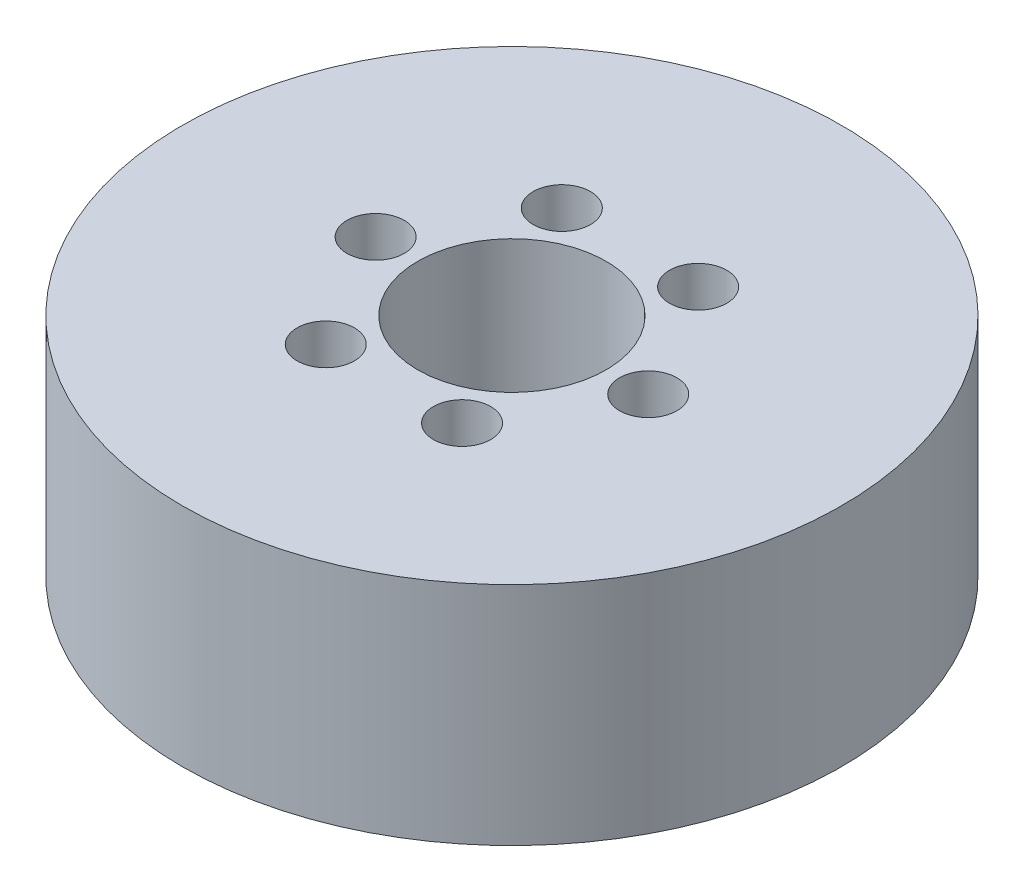
ISO-10303-21;
HEADER;
FILE_DESCRIPTION(('STEP AP214'),'2;1');
FILE_NAME('part.step','',(''),(''),'','','');
FILE_SCHEMA(('AUTOMOTIVE_DESIGN { 1 0 10303 214 1 1 1 1 }'));
ENDSEC;
DATA;
#1=APPLICATION_CONTEXT('core data for automotive mechanical design processes');
#2=APPLICATION_PROTOCOL_DEFINITION('international standard','automotive_design',2000,#1);
#3=PRODUCT_CONTEXT('',#1,'mechanical');
#4=PRODUCT('Part','Part','',(#3));
#5=PRODUCT_RELATED_PRODUCT_CATEGORY('part','',(#4));
#6=PRODUCT_DEFINITION_FORMATION('','',#4);
#7=PRODUCT_DEFINITION_CONTEXT('part definition',#1,'design');
#8=PRODUCT_DEFINITION('design','',#6,#7);
#9=PRODUCT_DEFINITION_SHAPE('','',#8);
#10=(LENGTH_UNIT() NAMED_UNIT(*) SI_UNIT(.MILLI.,.METRE.));
#11=(NAMED_UNIT(*) PLANE_ANGLE_UNIT() SI_UNIT($,.RADIAN.));
#12=(NAMED_UNIT(*) SI_UNIT($,.STERADIAN.) SOLID_ANGLE_UNIT());
#13=UNCERTAINTY_MEASURE_WITH_UNIT(LENGTH_MEASURE(1.E-05),#10,'distance_accuracy_value','');
#14=(GEOMETRIC_REPRESENTATION_CONTEXT(3) GLOBAL_UNCERTAINTY_ASSIGNED_CONTEXT((#13)) GLOBAL_UNIT_ASSIGNED_CONTEXT((#10,
#11,#12)) REPRESENTATION_CONTEXT('',''));
#15=CARTESIAN_POINT('',(0.,0.,0.));
#16=DIRECTION('',(0.,0.,1.));
#17=DIRECTION('',(1.,0.,0.));
#18=AXIS2_PLACEMENT_3D('',#15,#16,#17);
#19=CARTESIAN_POINT('',(0.,12.,0.));
#20=DIRECTION('',(0.,-1.,0.));
#21=DIRECTION('',(0.,0.,-1.));
#22=AXIS2_PLACEMENT_3D('',#19,#20,#21);
#23=CYLINDRICAL_SURFACE('',#22,17.5);
#24=CARTESIAN_POINT('',(0.,12.,0.));
#25=DIRECTION('',(0.,1.,0.));
#26=DIRECTION('',(0.,0.,1.));
#27=AXIS2_PLACEMENT_3D('',#24,#25,#26);
#28=CIRCLE('',#27,17.5);
#29=CARTESIAN_POINT('',(0.,12.,17.5));
#30=VERTEX_POINT('',#29);
#31=EDGE_CURVE('E10',#30,#30,#28,.T.);
#32=ORIENTED_EDGE('',*,*,#31,.F.);
#33=EDGE_LOOP('',(#32));
#34=FACE_BOUND('',#33,.T.);
#35=CARTESIAN_POINT('',(0.,0.,0.));
#36=DIRECTION('',(0.,1.,0.));
#37=DIRECTION('',(0.,0.,1.));
#38=AXIS2_PLACEMENT_3D('',#35,#36,#37);
#39=CIRCLE('',#38,17.5);
#40=CARTESIAN_POINT('',(0.,0.,17.5));
#41=VERTEX_POINT('',#40);
#42=EDGE_CURVE('E37',#41,#41,#39,.T.);
#43=ORIENTED_EDGE('',*,*,#42,.T.);
#44=EDGE_LOOP('',(#43));
#45=FACE_BOUND('',#44,.T.);
#46=ADVANCED_FACE('F40',(#34,#45),#23,.T.);
#47=CARTESIAN_POINT('',(0.,12.,0.));
#48=DIRECTION('',(0.,1.,0.));
#49=DIRECTION('',(0.,0.,1.));
#50=AXIS2_PLACEMENT_3D('',#47,#48,#49);
#51=PLANE('',#50);
#52=CARTESIAN_POINT('',(-3.61878021298596,12.,-6.26791119031643));
#53=DIRECTION('',(0.,1.,0.));
#54=DIRECTION('',(-0.866025403784433,0.,0.50000000000001));
#55=AXIS2_PLACEMENT_3D('',#52,#53,#54);
#56=CIRCLE('',#55,1.52167736658156);
#57=CARTESIAN_POINT('',(-4.93659146880939,12.,-5.50707250702564));
#58=VERTEX_POINT('',#57);
#59=EDGE_CURVE('E70',#58,#58,#56,.T.);
#60=ORIENTED_EDGE('',*,*,#59,.F.);
#61=EDGE_LOOP('',(#60));
#62=FACE_BOUND('',#61,.T.);
#63=CARTESIAN_POINT('',(3.61878021298583,12.,-6.26791119031651));
#64=DIRECTION('',(0.,1.,0.));
#65=DIRECTION('',(-0.866025403784443,0.,-0.499999999999992));
#66=AXIS2_PLACEMENT_3D('',#63,#64,#65);
#67=CIRCLE('',#66,1.52167736658156);
#68=CARTESIAN_POINT('',(2.30096895716238,12.,-7.02874987360728));
#69=VERTEX_POINT('',#68);
#70=EDGE_CURVE('E71',#69,#69,#67,.T.);
#71=ORIENTED_EDGE('',*,*,#70,.F.);
#72=EDGE_LOOP('',(#71));
#73=FACE_BOUND('',#72,.T.);
#74=CARTESIAN_POINT('',(7.23756042597177,12.,0.));
#75=DIRECTION('',(0.,1.,0.));
#76=DIRECTION('',(0.,0.,-1.));
#77=AXIS2_PLACEMENT_3D('',#74,#75,#76);
#78=CIRCLE('',#77,1.52167736658156);
#79=CARTESIAN_POINT('',(7.23756042597177,12.,-1.52167736658156));
#80=VERTEX_POINT('',#79);
#81=EDGE_CURVE('E78',#80,#80,#78,.T.);
#82=ORIENTED_EDGE('',*,*,#81,.F.);
#83=EDGE_LOOP('',(#82));
#84=FACE_BOUND('',#83,.T.);
#85=CARTESIAN_POINT('',(3.61878021298591,12.,6.26791119031646));
#86=DIRECTION('',(0.,1.,0.));
#87=DIRECTION('',(0.866025403784436,0.,-0.500000000000004));
#88=AXIS2_PLACEMENT_3D('',#85,#86,#87);
#89=CIRCLE('',#88,1.52167736658156);
#90=CARTESIAN_POINT('',(4.93659146880935,12.,5.50707250702567));
#91=VERTEX_POINT('',#90);
#92=EDGE_CURVE('E84',#91,#91,#89,.T.);
#93=ORIENTED_EDGE('',*,*,#92,.F.);
#94=EDGE_LOOP('',(#93));
#95=FACE_BOUND('',#94,.T.);
#96=CARTESIAN_POINT('',(-3.61878021298587,12.,6.26791119031648));
#97=DIRECTION('',(0.,1.,0.));
#98=DIRECTION('',(0.86602540378444,0.,0.499999999999998));
#99=AXIS2_PLACEMENT_3D('',#96,#97,#98);
#100=CIRCLE('',#99,1.52167736658156);
#101=CARTESIAN_POINT('',(-2.30096895716243,12.,7.02874987360726));
#102=VERTEX_POINT('',#101);
#103=EDGE_CURVE('E61',#102,#102,#100,.T.);
#104=ORIENTED_EDGE('',*,*,#103,.F.);
#105=EDGE_LOOP('',(#104));
#106=FACE_BOUND('',#105,.T.);
#107=CARTESIAN_POINT('',(-7.23756042597177,12.,0.));
#108=DIRECTION('',(0.,1.,0.));
#109=DIRECTION('',(0.,0.,1.));
#110=AXIS2_PLACEMENT_3D('',#107,#108,#109);
#111=CIRCLE('',#110,1.52167736658156);
#112=CARTESIAN_POINT('',(-7.23756042597177,12.,1.52167736658156));
#113=VERTEX_POINT('',#112);
#114=EDGE_CURVE('E54',#113,#113,#111,.T.);
#115=ORIENTED_EDGE('',*,*,#114,.F.);
#116=EDGE_LOOP('',(#115));
#117=FACE_BOUND('',#116,.T.);
#118=CARTESIAN_POINT('',(0.,12.,0.));
#119=DIRECTION('',(0.,1.,0.));
#120=DIRECTION('',(0.,0.,1.));
#121=AXIS2_PLACEMENT_3D('',#118,#119,#120);
#122=CIRCLE('',#121,5.);
#123=CARTESIAN_POINT('',(0.,12.,5.));
#124=VERTEX_POINT('',#123);
#125=EDGE_CURVE('E50',#124,#124,#122,.T.);
#126=ORIENTED_EDGE('',*,*,#125,.F.);
#127=EDGE_LOOP('',(#126));
#128=FACE_BOUND('',#127,.T.);
#129=ORIENTED_EDGE('',*,*,#31,.T.);
#130=EDGE_LOOP('',(#129));
#131=FACE_BOUND('',#130,.T.);
#132=ADVANCED_FACE('F99',(#62,#73,#84,#95,#106,#117,#128,#131),#51,.T.);
#133=CARTESIAN_POINT('',(0.,0.,0.));
#134=DIRECTION('',(0.,1.,0.));
#135=DIRECTION('',(0.,0.,1.));
#136=AXIS2_PLACEMENT_3D('',#133,#134,#135);
#137=PLANE('',#136);
#138=CARTESIAN_POINT('',(0.,0.,0.));
#139=DIRECTION('',(0.,1.,0.));
#140=DIRECTION('',(0.,0.,1.));
#141=AXIS2_PLACEMENT_3D('',#138,#139,#140);
#142=CIRCLE('',#141,5.);
#143=CARTESIAN_POINT('',(0.,0.,5.));
#144=VERTEX_POINT('',#143);
#145=EDGE_CURVE('E47',#144,#144,#142,.T.);
#146=ORIENTED_EDGE('',*,*,#145,.T.);
#147=EDGE_LOOP('',(#146));
#148=FACE_BOUND('',#147,.T.);
#149=ORIENTED_EDGE('',*,*,#42,.F.);
#150=EDGE_LOOP('',(#149));
#151=FACE_BOUND('',#150,.T.);
#152=ADVANCED_FACE('F103',(#148,#151),#137,.F.);
#153=CARTESIAN_POINT('',(0.,12.,0.));
#154=DIRECTION('',(0.,-1.,0.));
#155=DIRECTION('',(0.,0.,-1.));
#156=AXIS2_PLACEMENT_3D('',#153,#154,#155);
#157=CYLINDRICAL_SURFACE('',#156,5.);
#158=ORIENTED_EDGE('',*,*,#125,.T.);
#159=EDGE_LOOP('',(#158));
#160=FACE_BOUND('',#159,.T.);
#161=ORIENTED_EDGE('',*,*,#145,.F.);
#162=EDGE_LOOP('',(#161));
#163=FACE_BOUND('',#162,.T.);
#164=ADVANCED_FACE('F115',(#160,#163),#157,.F.);
#165=CARTESIAN_POINT('',(-7.23756042597177,1.26305994706101,0.));
#166=DIRECTION('',(0.,1.,0.));
#167=DIRECTION('',(0.,0.,1.));
#168=AXIS2_PLACEMENT_3D('',#165,#166,#167);
#169=CYLINDRICAL_SURFACE('',#168,1.52167736658156);
#170=CARTESIAN_POINT('',(-7.23756042597177,1.26305994706101,0.));
#171=DIRECTION('',(0.,1.,0.));
#172=DIRECTION('',(0.,0.,1.));
#173=AXIS2_PLACEMENT_3D('',#170,#171,#172);
#174=CIRCLE('',#173,1.52167736658156);
#175=CARTESIAN_POINT('',(-7.23756042597177,1.26305994706101,1.52167736658156));
#176=VERTEX_POINT('',#175);
#177=EDGE_CURVE('E55',#176,#176,#174,.T.);
#178=ORIENTED_EDGE('',*,*,#177,.F.);
#179=EDGE_LOOP('',(#178));
#180=FACE_BOUND('',#179,.T.);
#181=ORIENTED_EDGE('',*,*,#114,.T.);
#182=EDGE_LOOP('',(#181));
#183=FACE_BOUND('',#182,.T.);
#184=ADVANCED_FACE('F113',(#180,#183),#169,.F.);
#185=CARTESIAN_POINT('',(-7.23756042597177,1.26305994706101,0.));
#186=DIRECTION('',(0.,1.,0.));
#187=DIRECTION('',(0.,0.,1.));
#188=AXIS2_PLACEMENT_3D('',#185,#186,#187);
#189=PLANE('',#188);
#190=ORIENTED_EDGE('',*,*,#177,.T.);
#191=EDGE_LOOP('',(#190));
#192=FACE_BOUND('',#191,.T.);
#193=ADVANCED_FACE('F144',(#192),#189,.T.);
#194=CARTESIAN_POINT('',(-3.61878021298587,1.26305994706101,6.26791119031648));
#195=DIRECTION('',(0.,1.,0.));
#196=DIRECTION('',(0.,0.,1.));
#197=AXIS2_PLACEMENT_3D('',#194,#195,#196);
#198=CYLINDRICAL_SURFACE('',#197,1.52167736658156);
#199=CARTESIAN_POINT('',(-3.61878021298587,1.26305994706101,6.26791119031648));
#200=DIRECTION('',(0.,1.,0.));
#201=DIRECTION('',(0.86602540378444,0.,0.499999999999998));
#202=AXIS2_PLACEMENT_3D('',#199,#200,#201);
#203=CIRCLE('',#202,1.52167736658156);
#204=CARTESIAN_POINT('',(-2.30096895716243,1.26305994706101,7.02874987360726));
#205=VERTEX_POINT('',#204);
#206=EDGE_CURVE('E59',#205,#205,#203,.T.);
#207=ORIENTED_EDGE('',*,*,#206,.F.);
#208=EDGE_LOOP('',(#207));
#209=FACE_BOUND('',#208,.T.);
#210=ORIENTED_EDGE('',*,*,#103,.T.);
#211=EDGE_LOOP('',(#210));
#212=FACE_BOUND('',#211,.T.);
#213=ADVANCED_FACE('F153',(#209,#212),#198,.F.);
#214=CARTESIAN_POINT('',(-3.61878021298587,1.26305994706101,6.26791119031648));
#215=DIRECTION('',(0.,1.,0.));
#216=DIRECTION('',(0.86602540378444,0.,0.499999999999998));
#217=AXIS2_PLACEMENT_3D('',#214,#215,#216);
#218=PLANE('',#217);
#219=ORIENTED_EDGE('',*,*,#206,.T.);
#220=EDGE_LOOP('',(#219));
#221=FACE_BOUND('',#220,.T.);
#222=ADVANCED_FACE('F96',(#221),#218,.T.);
#223=CARTESIAN_POINT('',(3.61878021298591,1.26305994706101,6.26791119031646));
#224=DIRECTION('',(0.,1.,0.));
#225=DIRECTION('',(0.,0.,1.));
#226=AXIS2_PLACEMENT_3D('',#223,#224,#225);
#227=CYLINDRICAL_SURFACE('',#226,1.52167736658156);
#228=CARTESIAN_POINT('',(3.61878021298591,1.26305994706101,6.26791119031646));
#229=DIRECTION('',(0.,1.,0.));
#230=DIRECTION('',(0.866025403784436,0.,-0.500000000000004));
#231=AXIS2_PLACEMENT_3D('',#228,#229,#230);
#232=CIRCLE('',#231,1.52167736658156);
#233=CARTESIAN_POINT('',(4.93659146880935,1.26305994706101,5.50707250702567));
#234=VERTEX_POINT('',#233);
#235=EDGE_CURVE('E63',#234,#234,#232,.T.);
#236=ORIENTED_EDGE('',*,*,#235,.F.);
#237=EDGE_LOOP('',(#236));
#238=FACE_BOUND('',#237,.T.);
#239=ORIENTED_EDGE('',*,*,#92,.T.);
#240=EDGE_LOOP('',(#239));
#241=FACE_BOUND('',#240,.T.);
#242=ADVANCED_FACE('F91',(#238,#241),#227,.F.);
#243=CARTESIAN_POINT('',(3.61878021298591,1.26305994706101,6.26791119031646));
#244=DIRECTION('',(0.,1.,0.));
#245=DIRECTION('',(0.866025403784436,0.,-0.500000000000004));
#246=AXIS2_PLACEMENT_3D('',#243,#244,#245);
#247=PLANE('',#246);
#248=ORIENTED_EDGE('',*,*,#235,.T.);
#249=EDGE_LOOP('',(#248));
#250=FACE_BOUND('',#249,.T.);
#251=ADVANCED_FACE('F93',(#250),#247,.T.);
#252=CARTESIAN_POINT('',(7.23756042597177,1.26305994706101,0.));
#253=DIRECTION('',(0.,1.,0.));
#254=DIRECTION('',(0.,0.,1.));
#255=AXIS2_PLACEMENT_3D('',#252,#253,#254);
#256=CYLINDRICAL_SURFACE('',#255,1.52167736658156);
#257=CARTESIAN_POINT('',(7.23756042597177,1.26305994706101,0.));
#258=DIRECTION('',(0.,1.,0.));
#259=DIRECTION('',(0.,0.,-1.));
#260=AXIS2_PLACEMENT_3D('',#257,#258,#259);
#261=CIRCLE('',#260,1.52167736658156);
#262=CARTESIAN_POINT('',(7.23756042597177,1.26305994706101,-1.52167736658156));
#263=VERTEX_POINT('',#262);
#264=EDGE_CURVE('E85',#263,#263,#261,.T.);
#265=ORIENTED_EDGE('',*,*,#264,.F.);
#266=EDGE_LOOP('',(#265));
#267=FACE_BOUND('',#266,.T.);
#268=ORIENTED_EDGE('',*,*,#81,.T.);
#269=EDGE_LOOP('',(#268));
#270=FACE_BOUND('',#269,.T.);
#271=ADVANCED_FACE('F187',(#267,#270),#256,.F.);
#272=CARTESIAN_POINT('',(7.23756042597177,1.26305994706101,0.));
#273=DIRECTION('',(0.,1.,0.));
#274=DIRECTION('',(0.,0.,-1.));
#275=AXIS2_PLACEMENT_3D('',#272,#273,#274);
#276=PLANE('',#275);
#277=ORIENTED_EDGE('',*,*,#264,.T.);
#278=EDGE_LOOP('',(#277));
#279=FACE_BOUND('',#278,.T.);
#280=ADVANCED_FACE('F198',(#279),#276,.T.);
#281=CARTESIAN_POINT('',(3.61878021298583,1.26305994706101,-6.26791119031651));
#282=DIRECTION('',(0.,1.,0.));
#283=DIRECTION('',(0.,0.,1.));
#284=AXIS2_PLACEMENT_3D('',#281,#282,#283);
#285=CYLINDRICAL_SURFACE('',#284,1.52167736658156);
#286=CARTESIAN_POINT('',(3.61878021298583,1.26305994706101,-6.26791119031651));
#287=DIRECTION('',(0.,1.,0.));
#288=DIRECTION('',(-0.866025403784443,0.,-0.499999999999992));
#289=AXIS2_PLACEMENT_3D('',#286,#287,#288);
#290=CIRCLE('',#289,1.52167736658156);
#291=CARTESIAN_POINT('',(2.30096895716238,1.26305994706101,-7.02874987360728));
#292=VERTEX_POINT('',#291);
#293=EDGE_CURVE('E76',#292,#292,#290,.T.);
#294=ORIENTED_EDGE('',*,*,#293,.F.);
#295=EDGE_LOOP('',(#294));
#296=FACE_BOUND('',#295,.T.);
#297=ORIENTED_EDGE('',*,*,#70,.T.);
#298=EDGE_LOOP('',(#297));
#299=FACE_BOUND('',#298,.T.);
#300=ADVANCED_FACE('F202',(#296,#299),#285,.F.);
#301=CARTESIAN_POINT('',(3.61878021298583,1.26305994706101,-6.26791119031651));
#302=DIRECTION('',(0.,1.,0.));
#303=DIRECTION('',(-0.866025403784443,0.,-0.499999999999992));
#304=AXIS2_PLACEMENT_3D('',#301,#302,#303);
#305=PLANE('',#304);
#306=ORIENTED_EDGE('',*,*,#293,.T.);
#307=EDGE_LOOP('',(#306));
#308=FACE_BOUND('',#307,.T.);
#309=ADVANCED_FACE('F212',(#308),#305,.T.);
#310=CARTESIAN_POINT('',(-3.61878021298596,1.26305994706101,-6.26791119031643));
#311=DIRECTION('',(0.,1.,0.));
#312=DIRECTION('',(0.,0.,1.));
#313=AXIS2_PLACEMENT_3D('',#310,#311,#312);
#314=CYLINDRICAL_SURFACE('',#313,1.52167736658156);
#315=CARTESIAN_POINT('',(-3.61878021298596,1.26305994706101,-6.26791119031643));
#316=DIRECTION('',(0.,1.,0.));
#317=DIRECTION('',(-0.866025403784433,0.,0.50000000000001));
#318=AXIS2_PLACEMENT_3D('',#315,#316,#317);
#319=CIRCLE('',#318,1.52167736658156);
#320=CARTESIAN_POINT('',(-4.93659146880939,1.26305994706101,-5.50707250702564));
#321=VERTEX_POINT('',#320);
#322=EDGE_CURVE('E69',#321,#321,#319,.T.);
#323=ORIENTED_EDGE('',*,*,#322,.F.);
#324=EDGE_LOOP('',(#323));
#325=FACE_BOUND('',#324,.T.);
#326=ORIENTED_EDGE('',*,*,#59,.T.);
#327=EDGE_LOOP('',(#326));
#328=FACE_BOUND('',#327,.T.);
#329=ADVANCED_FACE('F224',(#325,#328),#314,.F.);
#330=CARTESIAN_POINT('',(-3.61878021298596,1.26305994706101,-6.26791119031643));
#331=DIRECTION('',(0.,1.,0.));
#332=DIRECTION('',(-0.866025403784433,0.,0.50000000000001));
#333=AXIS2_PLACEMENT_3D('',#330,#331,#332);
#334=PLANE('',#333);
#335=ORIENTED_EDGE('',*,*,#322,.T.);
#336=EDGE_LOOP('',(#335));
#337=FACE_BOUND('',#336,.T.);
#338=ADVANCED_FACE('F235',(#337),#334,.T.);
#339=CLOSED_SHELL('',(#46,#132,#152,#164,#184,#193,#213,#222,#242,#251,#271,#280,#300,#309,#329,#338));
#340=MANIFOLD_SOLID_BREP('B2',#339);
#341=ADVANCED_BREP_SHAPE_REPRESENTATION('',(#18,#340),#14);
#342=SHAPE_DEFINITION_REPRESENTATION(#9,#341);
ENDSEC;
END-ISO-10303-21;
